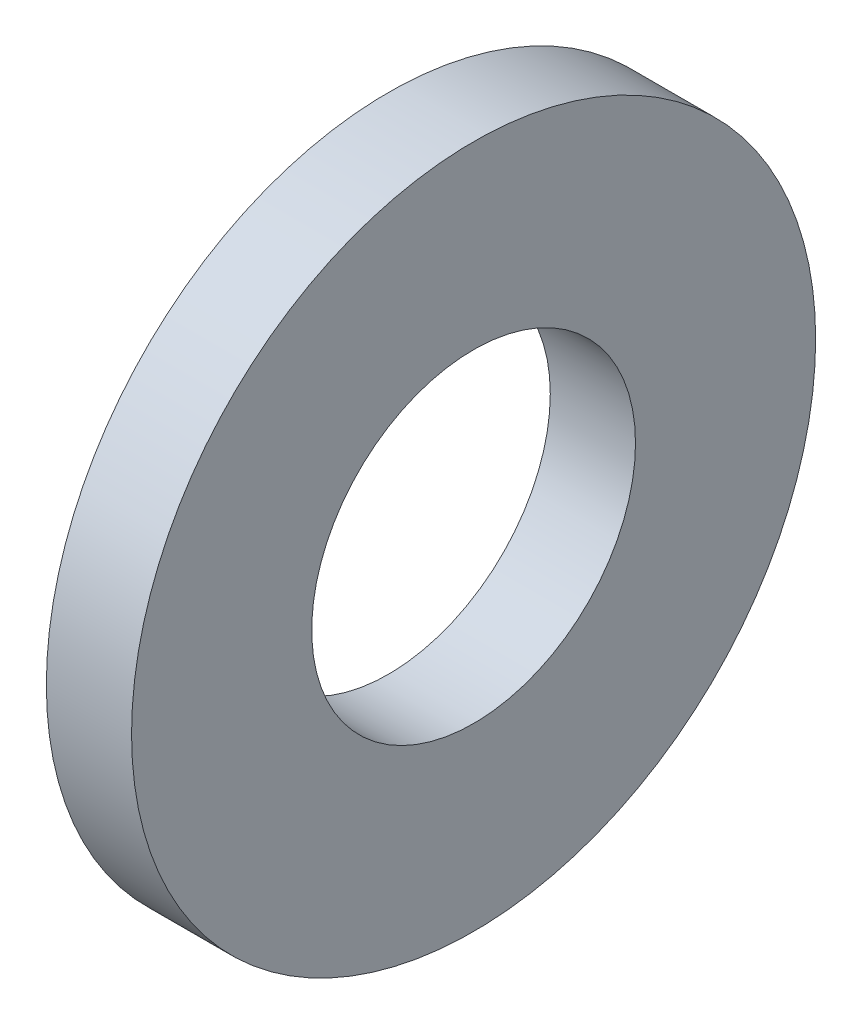
ISO-10303-21;
HEADER;
FILE_DESCRIPTION(('STEP AP214'),'2;1');
FILE_NAME('part.step','',(''),(''),'','','');
FILE_SCHEMA(('AUTOMOTIVE_DESIGN { 1 0 10303 214 1 1 1 1 }'));
ENDSEC;
DATA;
#1=APPLICATION_CONTEXT('core data for automotive mechanical design processes');
#2=APPLICATION_PROTOCOL_DEFINITION('international standard','automotive_design',2000,#1);
#3=PRODUCT_CONTEXT('',#1,'mechanical');
#4=PRODUCT('Part','Part','',(#3));
#5=PRODUCT_RELATED_PRODUCT_CATEGORY('part','',(#4));
#6=PRODUCT_DEFINITION_FORMATION('','',#4);
#7=PRODUCT_DEFINITION_CONTEXT('part definition',#1,'design');
#8=PRODUCT_DEFINITION('design','',#6,#7);
#9=PRODUCT_DEFINITION_SHAPE('','',#8);
#10=(LENGTH_UNIT() NAMED_UNIT(*) SI_UNIT(.MILLI.,.METRE.));
#11=(NAMED_UNIT(*) PLANE_ANGLE_UNIT() SI_UNIT($,.RADIAN.));
#12=(NAMED_UNIT(*) SI_UNIT($,.STERADIAN.) SOLID_ANGLE_UNIT());
#13=UNCERTAINTY_MEASURE_WITH_UNIT(LENGTH_MEASURE(1.E-05),#10,'distance_accuracy_value','');
#14=(GEOMETRIC_REPRESENTATION_CONTEXT(3) GLOBAL_UNCERTAINTY_ASSIGNED_CONTEXT((#13)) GLOBAL_UNIT_ASSIGNED_CONTEXT((#10,
#11,#12)) REPRESENTATION_CONTEXT('',''));
#15=CARTESIAN_POINT('',(0.,0.,0.));
#16=DIRECTION('',(0.,0.,1.));
#17=DIRECTION('',(1.,0.,0.));
#18=AXIS2_PLACEMENT_3D('',#15,#16,#17);
#19=CARTESIAN_POINT('',(1.778,0.,0.));
#20=DIRECTION('',(1.,0.,0.));
#21=DIRECTION('',(0.,0.,-1.));
#22=AXIS2_PLACEMENT_3D('',#19,#20,#21);
#23=PLANE('',#22);
#24=CARTESIAN_POINT('',(1.778,0.,0.));
#25=DIRECTION('',(1.,0.,0.));
#26=DIRECTION('',(0.,0.,-1.));
#27=AXIS2_PLACEMENT_3D('',#24,#25,#26);
#28=CIRCLE('',#27,7.1374);
#29=CARTESIAN_POINT('',(1.778,0.,-7.1374));
#30=VERTEX_POINT('',#29);
#31=EDGE_CURVE('E10',#30,#30,#28,.T.);
#32=ORIENTED_EDGE('',*,*,#31,.T.);
#33=EDGE_LOOP('',(#32));
#34=FACE_BOUND('',#33,.T.);
#35=CARTESIAN_POINT('',(1.778,0.,0.));
#36=DIRECTION('',(1.,0.,0.));
#37=DIRECTION('',(0.,0.,-1.));
#38=AXIS2_PLACEMENT_3D('',#35,#36,#37);
#39=CIRCLE('',#38,3.3782);
#40=CARTESIAN_POINT('',(1.778,0.,-3.3782));
#41=VERTEX_POINT('',#40);
#42=EDGE_CURVE('E41',#41,#41,#39,.T.);
#43=ORIENTED_EDGE('',*,*,#42,.F.);
#44=EDGE_LOOP('',(#43));
#45=FACE_BOUND('',#44,.T.);
#46=ADVANCED_FACE('F30',(#34,#45),#23,.T.);
#47=CARTESIAN_POINT('',(0.,0.,0.));
#48=DIRECTION('',(1.,0.,0.));
#49=DIRECTION('',(0.,0.,-1.));
#50=AXIS2_PLACEMENT_3D('',#47,#48,#49);
#51=PLANE('',#50);
#52=CARTESIAN_POINT('',(0.,0.,0.));
#53=DIRECTION('',(1.,0.,0.));
#54=DIRECTION('',(0.,0.,-1.));
#55=AXIS2_PLACEMENT_3D('',#52,#53,#54);
#56=CIRCLE('',#55,7.1374);
#57=CARTESIAN_POINT('',(0.,0.,-7.1374));
#58=VERTEX_POINT('',#57);
#59=EDGE_CURVE('E34',#58,#58,#56,.T.);
#60=ORIENTED_EDGE('',*,*,#59,.F.);
#61=EDGE_LOOP('',(#60));
#62=FACE_BOUND('',#61,.T.);
#63=CARTESIAN_POINT('',(0.,0.,0.));
#64=DIRECTION('',(1.,0.,0.));
#65=DIRECTION('',(0.,0.,-1.));
#66=AXIS2_PLACEMENT_3D('',#63,#64,#65);
#67=CIRCLE('',#66,3.3782);
#68=CARTESIAN_POINT('',(0.,0.,-3.3782));
#69=VERTEX_POINT('',#68);
#70=EDGE_CURVE('E43',#69,#69,#67,.T.);
#71=ORIENTED_EDGE('',*,*,#70,.T.);
#72=EDGE_LOOP('',(#71));
#73=FACE_BOUND('',#72,.T.);
#74=ADVANCED_FACE('F53',(#62,#73),#51,.F.);
#75=CARTESIAN_POINT('',(1.778,0.,0.));
#76=DIRECTION('',(-1.,0.,0.));
#77=DIRECTION('',(0.,0.,1.));
#78=AXIS2_PLACEMENT_3D('',#75,#76,#77);
#79=CYLINDRICAL_SURFACE('',#78,7.1374);
#80=ORIENTED_EDGE('',*,*,#31,.F.);
#81=EDGE_LOOP('',(#80));
#82=FACE_BOUND('',#81,.T.);
#83=ORIENTED_EDGE('',*,*,#59,.T.);
#84=EDGE_LOOP('',(#83));
#85=FACE_BOUND('',#84,.T.);
#86=ADVANCED_FACE('F32',(#82,#85),#79,.T.);
#87=CARTESIAN_POINT('',(1.778,0.,0.));
#88=DIRECTION('',(-1.,0.,0.));
#89=DIRECTION('',(0.,0.,1.));
#90=AXIS2_PLACEMENT_3D('',#87,#88,#89);
#91=CYLINDRICAL_SURFACE('',#90,3.3782);
#92=ORIENTED_EDGE('',*,*,#42,.T.);
#93=EDGE_LOOP('',(#92));
#94=FACE_BOUND('',#93,.T.);
#95=ORIENTED_EDGE('',*,*,#70,.F.);
#96=EDGE_LOOP('',(#95));
#97=FACE_BOUND('',#96,.T.);
#98=ADVANCED_FACE('F49',(#94,#97),#91,.F.);
#99=CLOSED_SHELL('',(#46,#74,#86,#98));
#100=MANIFOLD_SOLID_BREP('B2',#99);
#101=ADVANCED_BREP_SHAPE_REPRESENTATION('',(#18,#100),#14);
#102=SHAPE_DEFINITION_REPRESENTATION(#9,#101);
ENDSEC;
END-ISO-10303-21;
